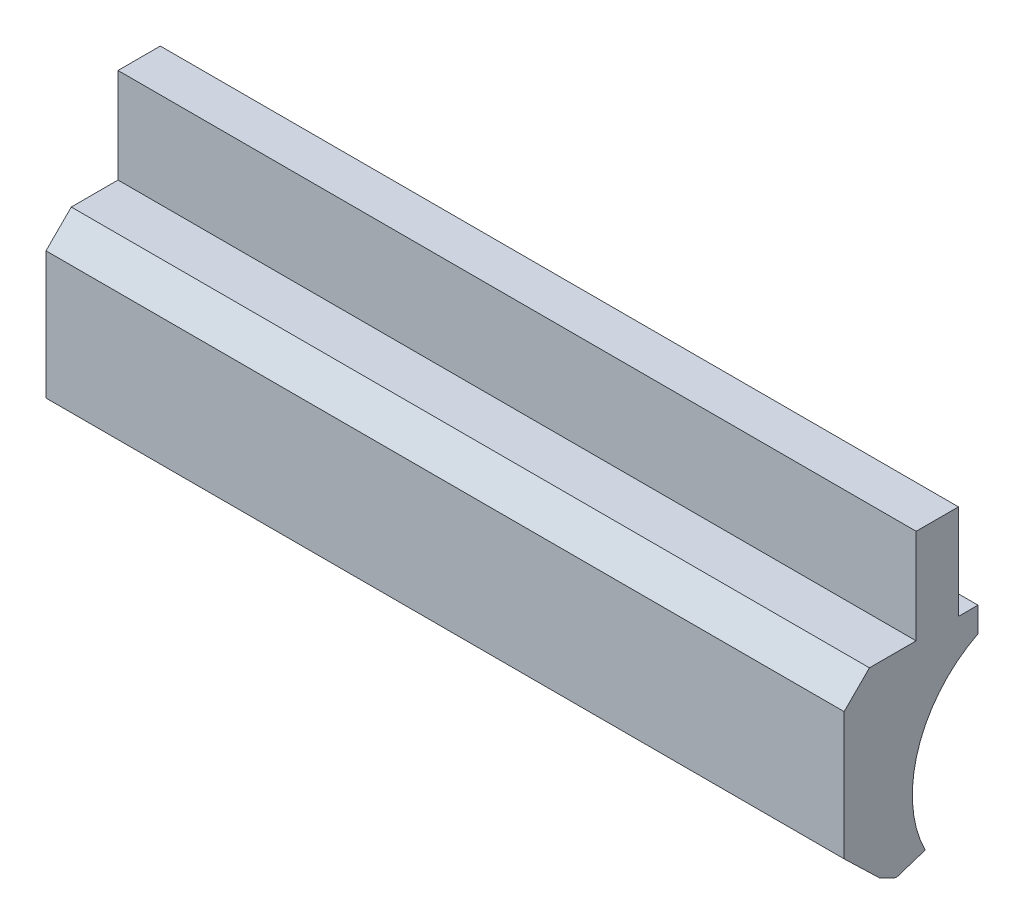
ISO-10303-21;
HEADER;
FILE_DESCRIPTION(('STEP AP214'),'2;1');
FILE_NAME('part.step','',(''),(''),'','','');
FILE_SCHEMA(('AUTOMOTIVE_DESIGN { 1 0 10303 214 1 1 1 1 }'));
ENDSEC;
DATA;
#1=APPLICATION_CONTEXT('core data for automotive mechanical design processes');
#2=APPLICATION_PROTOCOL_DEFINITION('international standard','automotive_design',2000,#1);
#3=PRODUCT_CONTEXT('',#1,'mechanical');
#4=PRODUCT('Part','Part','',(#3));
#5=PRODUCT_RELATED_PRODUCT_CATEGORY('part','',(#4));
#6=PRODUCT_DEFINITION_FORMATION('','',#4);
#7=PRODUCT_DEFINITION_CONTEXT('part definition',#1,'design');
#8=PRODUCT_DEFINITION('design','',#6,#7);
#9=PRODUCT_DEFINITION_SHAPE('','',#8);
#10=(LENGTH_UNIT() NAMED_UNIT(*) SI_UNIT(.MILLI.,.METRE.));
#11=(NAMED_UNIT(*) PLANE_ANGLE_UNIT() SI_UNIT($,.RADIAN.));
#12=(NAMED_UNIT(*) SI_UNIT($,.STERADIAN.) SOLID_ANGLE_UNIT());
#13=UNCERTAINTY_MEASURE_WITH_UNIT(LENGTH_MEASURE(1.E-05),#10,'distance_accuracy_value','');
#14=(GEOMETRIC_REPRESENTATION_CONTEXT(3) GLOBAL_UNCERTAINTY_ASSIGNED_CONTEXT((#13)) GLOBAL_UNIT_ASSIGNED_CONTEXT((#10,
#11,#12)) REPRESENTATION_CONTEXT('',''));
#15=CARTESIAN_POINT('',(0.,0.,0.));
#16=DIRECTION('',(0.,0.,1.));
#17=DIRECTION('',(1.,0.,0.));
#18=AXIS2_PLACEMENT_3D('',#15,#16,#17);
#19=CARTESIAN_POINT('',(10.,0.201549295774648,-0.181484261728899));
#20=DIRECTION('',(0.,0.,1.));
#21=DIRECTION('',(0.,-1.,0.));
#22=AXIS2_PLACEMENT_3D('',#19,#20,#21);
#23=PLANE('',#22);
#24=DIRECTION('',(0.,1.,0.));
#25=VECTOR('',#24,1.);
#26=CARTESIAN_POINT('',(0.,0.201549295774648,-0.181484261728899));
#27=LINE('',#26,#25);
#28=CARTESIAN_POINT('',(0.,-0.987434188614574,-0.1814842617289));
#29=VERTEX_POINT('',#28);
#30=CARTESIAN_POINT('',(0.,0.201549295774648,-0.181484261728899));
#31=VERTEX_POINT('',#30);
#32=EDGE_CURVE('E164',#29,#31,#27,.T.);
#33=ORIENTED_EDGE('',*,*,#32,.T.);
#34=DIRECTION('',(-1.,0.,0.));
#35=VECTOR('',#34,1.);
#36=CARTESIAN_POINT('',(10.,0.201549295774648,-0.181484261728899));
#37=LINE('',#36,#35);
#38=CARTESIAN_POINT('',(10.,0.201549295774648,-0.181484261728899));
#39=VERTEX_POINT('',#38);
#40=EDGE_CURVE('E11',#39,#31,#37,.T.);
#41=ORIENTED_EDGE('',*,*,#40,.F.);
#42=DIRECTION('',(0.,1.,0.));
#43=VECTOR('',#42,1.);
#44=CARTESIAN_POINT('',(10.,0.201549295774648,-0.181484261728899));
#45=LINE('',#44,#43);
#46=CARTESIAN_POINT('',(10.,-0.987434188614574,-0.1814842617289));
#47=VERTEX_POINT('',#46);
#48=EDGE_CURVE('E198',#47,#39,#45,.T.);
#49=ORIENTED_EDGE('',*,*,#48,.F.);
#50=DIRECTION('',(-1.,0.,0.));
#51=VECTOR('',#50,1.);
#52=CARTESIAN_POINT('',(10.,-0.987434188614574,-0.1814842617289));
#53=LINE('',#52,#51);
#54=EDGE_CURVE('E160',#47,#29,#53,.T.);
#55=ORIENTED_EDGE('',*,*,#54,.T.);
#56=EDGE_LOOP('',(#33,#41,#49,#55));
#57=FACE_BOUND('',#56,.T.);
#58=ADVANCED_FACE('F39',(#57),#23,.F.);
#59=CARTESIAN_POINT('',(10.,0.201549295774648,-0.181484261728899));
#60=DIRECTION('',(0.,-1.,0.));
#61=DIRECTION('',(0.,0.,-1.));
#62=AXIS2_PLACEMENT_3D('',#59,#60,#61);
#63=PLANE('',#62);
#64=DIRECTION('',(0.,0.,1.));
#65=VECTOR('',#64,1.);
#66=CARTESIAN_POINT('',(0.,0.201549295774648,-0.181484261728899));
#67=LINE('',#66,#65);
#68=CARTESIAN_POINT('',(0.,0.201549295774648,0.348515738271101));
#69=VERTEX_POINT('',#68);
#70=EDGE_CURVE('E168',#31,#69,#67,.T.);
#71=ORIENTED_EDGE('',*,*,#70,.T.);
#72=DIRECTION('',(-1.,0.,0.));
#73=VECTOR('',#72,1.);
#74=CARTESIAN_POINT('',(10.,0.201549295774648,0.348515738271101));
#75=LINE('',#74,#73);
#76=CARTESIAN_POINT('',(10.,0.201549295774648,0.348515738271101));
#77=VERTEX_POINT('',#76);
#78=EDGE_CURVE('E48',#77,#69,#75,.T.);
#79=ORIENTED_EDGE('',*,*,#78,.F.);
#80=DIRECTION('',(0.,0.,1.));
#81=VECTOR('',#80,1.);
#82=CARTESIAN_POINT('',(10.,0.201549295774648,-0.181484261728899));
#83=LINE('',#82,#81);
#84=EDGE_CURVE('E111',#39,#77,#83,.T.);
#85=ORIENTED_EDGE('',*,*,#84,.F.);
#86=ORIENTED_EDGE('',*,*,#40,.T.);
#87=EDGE_LOOP('',(#71,#79,#85,#86));
#88=FACE_BOUND('',#87,.T.);
#89=ADVANCED_FACE('F292',(#88),#63,.F.);
#90=CARTESIAN_POINT('',(10.,0.201549295774648,0.348515738271101));
#91=DIRECTION('',(0.,0.,-1.));
#92=DIRECTION('',(0.,1.,0.));
#93=AXIS2_PLACEMENT_3D('',#90,#91,#92);
#94=PLANE('',#93);
#95=DIRECTION('',(0.,-1.,0.));
#96=VECTOR('',#95,1.);
#97=CARTESIAN_POINT('',(0.,0.201549295774648,0.348515738271101));
#98=LINE('',#97,#96);
#99=CARTESIAN_POINT('',(0.,-0.987434188614574,0.348515738271101));
#100=VERTEX_POINT('',#99);
#101=EDGE_CURVE('E171',#69,#100,#98,.T.);
#102=ORIENTED_EDGE('',*,*,#101,.T.);
#103=DIRECTION('',(-1.,0.,0.));
#104=VECTOR('',#103,1.);
#105=CARTESIAN_POINT('',(10.,-0.987434188614574,0.348515738271101));
#106=LINE('',#105,#104);
#107=CARTESIAN_POINT('',(10.,-0.987434188614574,0.348515738271101));
#108=VERTEX_POINT('',#107);
#109=EDGE_CURVE('E225',#108,#100,#106,.T.);
#110=ORIENTED_EDGE('',*,*,#109,.F.);
#111=DIRECTION('',(0.,-1.,0.));
#112=VECTOR('',#111,1.);
#113=CARTESIAN_POINT('',(10.,0.201549295774648,0.348515738271101));
#114=LINE('',#113,#112);
#115=EDGE_CURVE('E235',#77,#108,#114,.T.);
#116=ORIENTED_EDGE('',*,*,#115,.F.);
#117=ORIENTED_EDGE('',*,*,#78,.T.);
#118=EDGE_LOOP('',(#102,#110,#116,#117));
#119=FACE_BOUND('',#118,.T.);
#120=ADVANCED_FACE('F233',(#119),#94,.F.);
#121=CARTESIAN_POINT('',(10.,-0.987434188614574,0.348515738271101));
#122=DIRECTION('',(0.,-1.,0.));
#123=DIRECTION('',(0.,0.,-1.));
#124=AXIS2_PLACEMENT_3D('',#121,#122,#123);
#125=PLANE('',#124);
#126=DIRECTION('',(0.,0.,1.));
#127=VECTOR('',#126,1.);
#128=CARTESIAN_POINT('',(0.,-0.987434188614574,0.348515738271101));
#129=LINE('',#128,#127);
#130=CARTESIAN_POINT('',(0.,-0.987434188614574,0.933817852581203));
#131=VERTEX_POINT('',#130);
#132=EDGE_CURVE('E174',#100,#131,#129,.T.);
#133=ORIENTED_EDGE('',*,*,#132,.T.);
#134=DIRECTION('',(-1.,0.,0.));
#135=VECTOR('',#134,1.);
#136=CARTESIAN_POINT('',(10.,-0.987434188614574,0.933817852581203));
#137=LINE('',#136,#135);
#138=CARTESIAN_POINT('',(10.,-0.987434188614574,0.933817852581203));
#139=VERTEX_POINT('',#138);
#140=EDGE_CURVE('E221',#139,#131,#137,.T.);
#141=ORIENTED_EDGE('',*,*,#140,.F.);
#142=DIRECTION('',(0.,0.,1.));
#143=VECTOR('',#142,1.);
#144=CARTESIAN_POINT('',(10.,-0.987434188614574,0.348515738271101));
#145=LINE('',#144,#143);
#146=EDGE_CURVE('E254',#108,#139,#145,.T.);
#147=ORIENTED_EDGE('',*,*,#146,.F.);
#148=ORIENTED_EDGE('',*,*,#109,.T.);
#149=EDGE_LOOP('',(#133,#141,#147,#148));
#150=FACE_BOUND('',#149,.T.);
#151=ADVANCED_FACE('F244',(#150),#125,.F.);
#152=CARTESIAN_POINT('',(10.,-0.987434188614574,0.933817852581203));
#153=DIRECTION('',(0.,-0.707106781186546,-0.707106781186549));
#154=DIRECTION('',(0.,0.707106781186549,-0.707106781186546));
#155=AXIS2_PLACEMENT_3D('',#152,#153,#154);
#156=PLANE('',#155);
#157=DIRECTION('',(0.,-0.707106781186549,0.707106781186546));
#158=VECTOR('',#157,1.);
#159=CARTESIAN_POINT('',(0.,-0.987434188614574,0.933817852581203));
#160=LINE('',#159,#158);
#161=CARTESIAN_POINT('',(0.,-1.30425357632331,1.25063724028994));
#162=VERTEX_POINT('',#161);
#163=EDGE_CURVE('E177',#131,#162,#160,.T.);
#164=ORIENTED_EDGE('',*,*,#163,.T.);
#165=DIRECTION('',(-1.,0.,0.));
#166=VECTOR('',#165,1.);
#167=CARTESIAN_POINT('',(10.,-1.30425357632331,1.25063724028994));
#168=LINE('',#167,#166);
#169=CARTESIAN_POINT('',(10.,-1.30425357632331,1.25063724028994));
#170=VERTEX_POINT('',#169);
#171=EDGE_CURVE('E217',#170,#162,#168,.T.);
#172=ORIENTED_EDGE('',*,*,#171,.F.);
#173=DIRECTION('',(0.,-0.707106781186549,0.707106781186546));
#174=VECTOR('',#173,1.);
#175=CARTESIAN_POINT('',(10.,-0.987434188614574,0.933817852581203));
#176=LINE('',#175,#174);
#177=EDGE_CURVE('E250',#139,#170,#176,.T.);
#178=ORIENTED_EDGE('',*,*,#177,.F.);
#179=ORIENTED_EDGE('',*,*,#140,.T.);
#180=EDGE_LOOP('',(#164,#172,#178,#179));
#181=FACE_BOUND('',#180,.T.);
#182=ADVANCED_FACE('F248',(#181),#156,.F.);
#183=CARTESIAN_POINT('',(10.,-1.30425357632331,1.25063724028994));
#184=DIRECTION('',(0.,0.,-1.));
#185=DIRECTION('',(-1.,0.,0.));
#186=AXIS2_PLACEMENT_3D('',#183,#184,#185);
#187=PLANE('',#186);
#188=DIRECTION('',(0.,-1.,0.));
#189=VECTOR('',#188,1.);
#190=CARTESIAN_POINT('',(0.,-1.30425357632331,1.25063724028994));
#191=LINE('',#190,#189);
#192=CARTESIAN_POINT('',(0.,-2.90237590784205,1.25063724028994));
#193=VERTEX_POINT('',#192);
#194=EDGE_CURVE('E180',#162,#193,#191,.T.);
#195=ORIENTED_EDGE('',*,*,#194,.T.);
#196=DIRECTION('',(-1.,0.,0.));
#197=VECTOR('',#196,1.);
#198=CARTESIAN_POINT('',(10.,-2.90237590784205,1.25063724028994));
#199=LINE('',#198,#197);
#200=CARTESIAN_POINT('',(10.,-2.90237590784205,1.25063724028994));
#201=VERTEX_POINT('',#200);
#202=EDGE_CURVE('E213',#201,#193,#199,.T.);
#203=ORIENTED_EDGE('',*,*,#202,.F.);
#204=DIRECTION('',(0.,-1.,0.));
#205=VECTOR('',#204,1.);
#206=CARTESIAN_POINT('',(10.,-1.30425357632331,1.25063724028994));
#207=LINE('',#206,#205);
#208=EDGE_CURVE('E253',#170,#201,#207,.T.);
#209=ORIENTED_EDGE('',*,*,#208,.F.);
#210=ORIENTED_EDGE('',*,*,#171,.T.);
#211=EDGE_LOOP('',(#195,#203,#209,#210));
#212=FACE_BOUND('',#211,.T.);
#213=ADVANCED_FACE('F305',(#212),#187,.F.);
#214=CARTESIAN_POINT('',(10.,-2.90237590784205,1.25063724028994));
#215=DIRECTION('',(0.,0.719339800338653,-0.694658370458996));
#216=DIRECTION('',(0.,0.694658370458996,0.719339800338653));
#217=AXIS2_PLACEMENT_3D('',#214,#215,#216);
#218=PLANE('',#217);
#219=DIRECTION('',(0.,-0.694658370458996,-0.719339800338653));
#220=VECTOR('',#219,1.);
#221=CARTESIAN_POINT('',(0.,-2.90237590784205,1.25063724028994));
#222=LINE('',#221,#220);
#223=CARTESIAN_POINT('',(0.,-3.33133600411788,0.80643605718979));
#224=VERTEX_POINT('',#223);
#225=EDGE_CURVE('E183',#193,#224,#222,.T.);
#226=ORIENTED_EDGE('',*,*,#225,.T.);
#227=DIRECTION('',(-1.,0.,0.));
#228=VECTOR('',#227,1.);
#229=CARTESIAN_POINT('',(10.,-3.33133600411788,0.80643605718979));
#230=LINE('',#229,#228);
#231=CARTESIAN_POINT('',(10.,-3.33133600411788,0.80643605718979));
#232=VERTEX_POINT('',#231);
#233=EDGE_CURVE('E209',#232,#224,#230,.T.);
#234=ORIENTED_EDGE('',*,*,#233,.F.);
#235=DIRECTION('',(0.,-0.694658370458996,-0.719339800338653));
#236=VECTOR('',#235,1.);
#237=CARTESIAN_POINT('',(10.,-2.90237590784205,1.25063724028994));
#238=LINE('',#237,#236);
#239=EDGE_CURVE('E258',#201,#232,#238,.T.);
#240=ORIENTED_EDGE('',*,*,#239,.F.);
#241=ORIENTED_EDGE('',*,*,#202,.T.);
#242=EDGE_LOOP('',(#226,#234,#240,#241));
#243=FACE_BOUND('',#242,.T.);
#244=ADVANCED_FACE('F308',(#243),#218,.F.);
#245=CARTESIAN_POINT('',(10.,-3.33133600411788,0.80643605718979));
#246=DIRECTION('',(0.,0.898794046299162,-0.438371146789088));
#247=DIRECTION('',(0.,0.438371146789088,0.898794046299162));
#248=AXIS2_PLACEMENT_3D('',#245,#246,#247);
#249=PLANE('',#248);
#250=DIRECTION('',(0.,-0.438371146789088,-0.898794046299162));
#251=VECTOR('',#250,1.);
#252=CARTESIAN_POINT('',(0.,-3.33133600411788,0.80643605718979));
#253=LINE('',#252,#251);
#254=CARTESIAN_POINT('',(0.,-3.43262926089275,0.598754103698204));
#255=VERTEX_POINT('',#254);
#256=EDGE_CURVE('E186',#224,#255,#253,.T.);
#257=ORIENTED_EDGE('',*,*,#256,.T.);
#258=DIRECTION('',(-1.,0.,0.));
#259=VECTOR('',#258,1.);
#260=CARTESIAN_POINT('',(10.,-3.43262926089275,0.598754103698204));
#261=LINE('',#260,#259);
#262=CARTESIAN_POINT('',(10.,-3.43262926089275,0.598754103698204));
#263=VERTEX_POINT('',#262);
#264=EDGE_CURVE('E205',#263,#255,#261,.T.);
#265=ORIENTED_EDGE('',*,*,#264,.F.);
#266=DIRECTION('',(0.,-0.438371146789088,-0.898794046299162));
#267=VECTOR('',#266,1.);
#268=CARTESIAN_POINT('',(10.,-3.33133600411788,0.80643605718979));
#269=LINE('',#268,#267);
#270=EDGE_CURVE('E265',#232,#263,#269,.T.);
#271=ORIENTED_EDGE('',*,*,#270,.F.);
#272=ORIENTED_EDGE('',*,*,#233,.T.);
#273=EDGE_LOOP('',(#257,#265,#271,#272));
#274=FACE_BOUND('',#273,.T.);
#275=ADVANCED_FACE('F273',(#274),#249,.F.);
#276=CARTESIAN_POINT('',(10.,-3.43262926089275,0.598754103698204));
#277=DIRECTION('',(0.,0.951056516295156,0.30901699437494));
#278=DIRECTION('',(0.,-0.30901699437494,0.951056516295156));
#279=AXIS2_PLACEMENT_3D('',#276,#277,#278);
#280=PLANE('',#279);
#281=DIRECTION('',(0.,0.30901699437494,-0.951056516295156));
#282=VECTOR('',#281,1.);
#283=CARTESIAN_POINT('',(0.,-3.43262926089275,0.598754103698204));
#284=LINE('',#283,#282);
#285=CARTESIAN_POINT('',(0.,-3.31439465509223,0.234865403901531));
#286=VERTEX_POINT('',#285);
#287=EDGE_CURVE('E189',#255,#286,#284,.T.);
#288=ORIENTED_EDGE('',*,*,#287,.T.);
#289=DIRECTION('',(-1.,0.,0.));
#290=VECTOR('',#289,1.);
#291=CARTESIAN_POINT('',(10.,-3.31439465509223,0.234865403901531));
#292=LINE('',#291,#290);
#293=CARTESIAN_POINT('',(10.,-3.31439465509223,0.234865403901531));
#294=VERTEX_POINT('',#293);
#295=EDGE_CURVE('E153',#294,#286,#292,.T.);
#296=ORIENTED_EDGE('',*,*,#295,.F.);
#297=DIRECTION('',(0.,0.30901699437494,-0.951056516295156));
#298=VECTOR('',#297,1.);
#299=CARTESIAN_POINT('',(10.,-3.43262926089275,0.598754103698204));
#300=LINE('',#299,#298);
#301=EDGE_CURVE('E142',#263,#294,#300,.T.);
#302=ORIENTED_EDGE('',*,*,#301,.F.);
#303=ORIENTED_EDGE('',*,*,#264,.T.);
#304=EDGE_LOOP('',(#288,#296,#302,#303));
#305=FACE_BOUND('',#304,.T.);
#306=ADVANCED_FACE('F277',(#305),#280,.F.);
#307=CARTESIAN_POINT('',(10.,-2.63724525857334,-1.10359217659682));
#308=DIRECTION('',(-1.,0.,0.));
#309=DIRECTION('',(0.,0.,1.));
#310=AXIS2_PLACEMENT_3D('',#307,#308,#309);
#311=CYLINDRICAL_SURFACE('',#310,1.4999999999998);
#312=CARTESIAN_POINT('',(0.,-2.63724525857334,-1.10359217659682));
#313=DIRECTION('',(-1.,0.,0.));
#314=DIRECTION('',(0.,0.,1.));
#315=AXIS2_PLACEMENT_3D('',#312,#313,#314);
#316=CIRCLE('',#315,1.4999999999998);
#317=CARTESIAN_POINT('',(0.,-1.29878767807496,-0.426442780077976));
#318=VERTEX_POINT('',#317);
#319=EDGE_CURVE('E151',#286,#318,#316,.T.);
#320=ORIENTED_EDGE('',*,*,#319,.T.);
#321=DIRECTION('',(-1.,0.,0.));
#322=VECTOR('',#321,1.);
#323=CARTESIAN_POINT('',(10.,-1.29878767807496,-0.426442780077976));
#324=LINE('',#323,#322);
#325=CARTESIAN_POINT('',(10.,-1.29878767807496,-0.426442780077976));
#326=VERTEX_POINT('',#325);
#327=EDGE_CURVE('E148',#326,#318,#324,.T.);
#328=ORIENTED_EDGE('',*,*,#327,.F.);
#329=CARTESIAN_POINT('',(10.,-2.63724525857334,-1.10359217659682));
#330=DIRECTION('',(-1.,0.,0.));
#331=DIRECTION('',(0.,0.,1.));
#332=AXIS2_PLACEMENT_3D('',#329,#330,#331);
#333=CIRCLE('',#332,1.4999999999998);
#334=EDGE_CURVE('E136',#294,#326,#333,.T.);
#335=ORIENTED_EDGE('',*,*,#334,.F.);
#336=ORIENTED_EDGE('',*,*,#295,.T.);
#337=EDGE_LOOP('',(#320,#328,#335,#336));
#338=FACE_BOUND('',#337,.T.);
#339=ADVANCED_FACE('F149',(#338),#311,.F.);
#340=CARTESIAN_POINT('',(10.,-1.29878767807496,-0.426442780077977));
#341=DIRECTION('',(0.,0.,1.));
#342=DIRECTION('',(1.,0.,0.));
#343=AXIS2_PLACEMENT_3D('',#340,#341,#342);
#344=PLANE('',#343);
#345=DIRECTION('',(0.,1.,0.));
#346=VECTOR('',#345,1.);
#347=CARTESIAN_POINT('',(0.,-1.29878767807496,-0.426442780077977));
#348=LINE('',#347,#346);
#349=CARTESIAN_POINT('',(0.,-0.987434188614574,-0.426442780077977));
#350=VERTEX_POINT('',#349);
#351=EDGE_CURVE('E97',#318,#350,#348,.T.);
#352=ORIENTED_EDGE('',*,*,#351,.T.);
#353=DIRECTION('',(-1.,0.,0.));
#354=VECTOR('',#353,1.);
#355=CARTESIAN_POINT('',(10.,-0.987434188614574,-0.426442780077977));
#356=LINE('',#355,#354);
#357=CARTESIAN_POINT('',(10.,-0.987434188614574,-0.426442780077977));
#358=VERTEX_POINT('',#357);
#359=EDGE_CURVE('E154',#358,#350,#356,.T.);
#360=ORIENTED_EDGE('',*,*,#359,.F.);
#361=DIRECTION('',(0.,1.,0.));
#362=VECTOR('',#361,1.);
#363=CARTESIAN_POINT('',(10.,-1.29878767807496,-0.426442780077977));
#364=LINE('',#363,#362);
#365=EDGE_CURVE('E140',#326,#358,#364,.T.);
#366=ORIENTED_EDGE('',*,*,#365,.F.);
#367=ORIENTED_EDGE('',*,*,#327,.T.);
#368=EDGE_LOOP('',(#352,#360,#366,#367));
#369=FACE_BOUND('',#368,.T.);
#370=ADVANCED_FACE('F156',(#369),#344,.F.);
#371=CARTESIAN_POINT('',(10.,-0.987434188614574,-0.426442780077977));
#372=DIRECTION('',(0.,-1.,0.));
#373=DIRECTION('',(0.,0.,-1.));
#374=AXIS2_PLACEMENT_3D('',#371,#372,#373);
#375=PLANE('',#374);
#376=DIRECTION('',(0.,0.,1.));
#377=VECTOR('',#376,1.);
#378=CARTESIAN_POINT('',(0.,-0.987434188614574,-0.426442780077977));
#379=LINE('',#378,#377);
#380=EDGE_CURVE('E103',#350,#29,#379,.T.);
#381=ORIENTED_EDGE('',*,*,#380,.T.);
#382=ORIENTED_EDGE('',*,*,#54,.F.);
#383=DIRECTION('',(0.,0.,1.));
#384=VECTOR('',#383,1.);
#385=CARTESIAN_POINT('',(10.,-0.987434188614574,-0.426442780077977));
#386=LINE('',#385,#384);
#387=EDGE_CURVE('E56',#358,#47,#386,.T.);
#388=ORIENTED_EDGE('',*,*,#387,.F.);
#389=ORIENTED_EDGE('',*,*,#359,.T.);
#390=EDGE_LOOP('',(#381,#382,#388,#389));
#391=FACE_BOUND('',#390,.T.);
#392=ADVANCED_FACE('F281',(#391),#375,.F.);
#393=CARTESIAN_POINT('',(10.,-2.63724525857334,-1.10359217659682));
#394=DIRECTION('',(-1.,0.,0.));
#395=DIRECTION('',(0.,0.,1.));
#396=AXIS2_PLACEMENT_3D('',#393,#394,#395);
#397=PLANE('',#396);
#398=ORIENTED_EDGE('',*,*,#48,.T.);
#399=ORIENTED_EDGE('',*,*,#84,.T.);
#400=ORIENTED_EDGE('',*,*,#115,.T.);
#401=ORIENTED_EDGE('',*,*,#146,.T.);
#402=ORIENTED_EDGE('',*,*,#177,.T.);
#403=ORIENTED_EDGE('',*,*,#208,.T.);
#404=ORIENTED_EDGE('',*,*,#239,.T.);
#405=ORIENTED_EDGE('',*,*,#270,.T.);
#406=ORIENTED_EDGE('',*,*,#301,.T.);
#407=ORIENTED_EDGE('',*,*,#334,.T.);
#408=ORIENTED_EDGE('',*,*,#365,.T.);
#409=ORIENTED_EDGE('',*,*,#387,.T.);
#410=EDGE_LOOP('',(#398,#399,#400,#401,#402,#403,#404,#405,#406,#407,#408,#409));
#411=FACE_BOUND('',#410,.T.);
#412=ADVANCED_FACE('F138',(#411),#397,.F.);
#413=CARTESIAN_POINT('',(0.,-2.63724525857334,-1.10359217659682));
#414=DIRECTION('',(-1.,0.,0.));
#415=DIRECTION('',(0.,0.,1.));
#416=AXIS2_PLACEMENT_3D('',#413,#414,#415);
#417=PLANE('',#416);
#418=ORIENTED_EDGE('',*,*,#32,.F.);
#419=ORIENTED_EDGE('',*,*,#380,.F.);
#420=ORIENTED_EDGE('',*,*,#351,.F.);
#421=ORIENTED_EDGE('',*,*,#319,.F.);
#422=ORIENTED_EDGE('',*,*,#287,.F.);
#423=ORIENTED_EDGE('',*,*,#256,.F.);
#424=ORIENTED_EDGE('',*,*,#225,.F.);
#425=ORIENTED_EDGE('',*,*,#194,.F.);
#426=ORIENTED_EDGE('',*,*,#163,.F.);
#427=ORIENTED_EDGE('',*,*,#132,.F.);
#428=ORIENTED_EDGE('',*,*,#101,.F.);
#429=ORIENTED_EDGE('',*,*,#70,.F.);
#430=EDGE_LOOP('',(#418,#419,#420,#421,#422,#423,#424,#425,#426,#427,#428,#429));
#431=FACE_BOUND('',#430,.T.);
#432=ADVANCED_FACE('F239',(#431),#417,.T.);
#433=CLOSED_SHELL('',(#58,#89,#120,#151,#182,#213,#244,#275,#306,#339,#370,#392,#412,#432));
#434=MANIFOLD_SOLID_BREP('B2',#433);
#435=ADVANCED_BREP_SHAPE_REPRESENTATION('',(#18,#434),#14);
#436=SHAPE_DEFINITION_REPRESENTATION(#9,#435);
ENDSEC;
END-ISO-10303-21;
